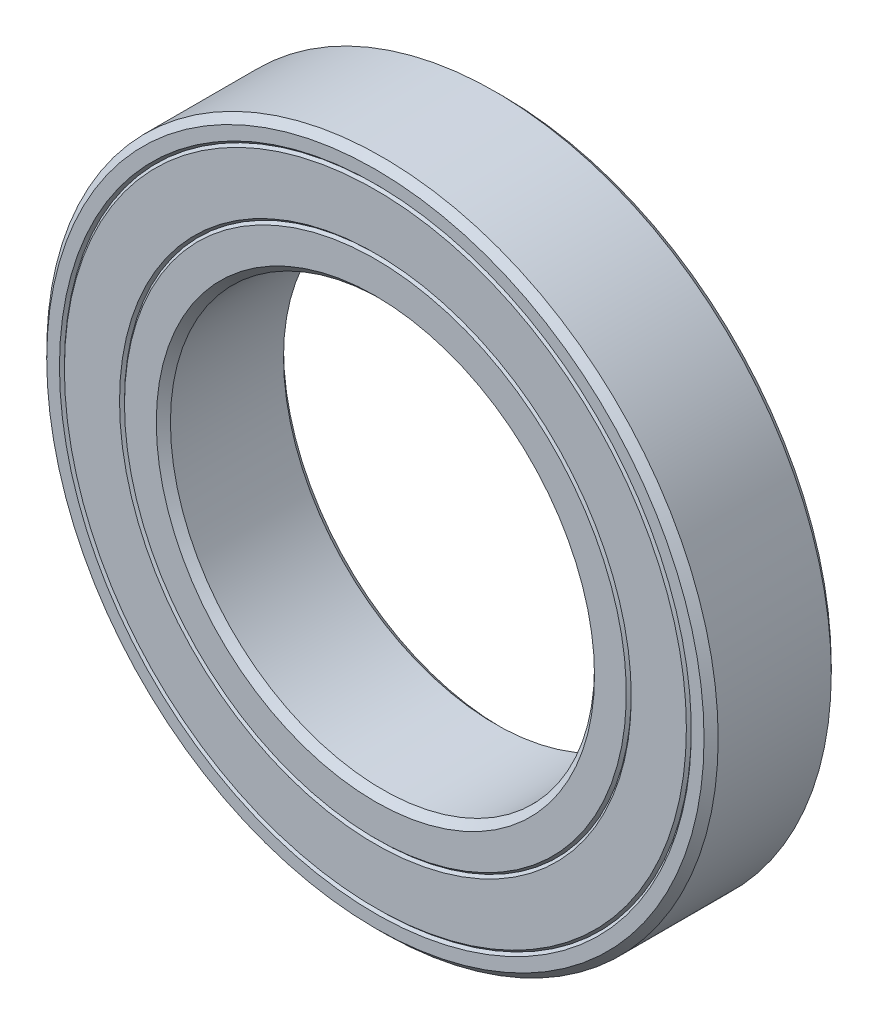
ISO-10303-21;
HEADER;
FILE_DESCRIPTION(('STEP AP214'),'2;1');
FILE_NAME('part.step','',(''),(''),'','','');
FILE_SCHEMA(('AUTOMOTIVE_DESIGN { 1 0 10303 214 1 1 1 1 }'));
ENDSEC;
DATA;
#1=APPLICATION_CONTEXT('core data for automotive mechanical design processes');
#2=APPLICATION_PROTOCOL_DEFINITION('international standard','automotive_design',2000,#1);
#3=PRODUCT_CONTEXT('',#1,'mechanical');
#4=PRODUCT('Part','Part','',(#3));
#5=PRODUCT_RELATED_PRODUCT_CATEGORY('part','',(#4));
#6=PRODUCT_DEFINITION_FORMATION('','',#4);
#7=PRODUCT_DEFINITION_CONTEXT('part definition',#1,'design');
#8=PRODUCT_DEFINITION('design','',#6,#7);
#9=PRODUCT_DEFINITION_SHAPE('','',#8);
#10=(LENGTH_UNIT() NAMED_UNIT(*) SI_UNIT(.MILLI.,.METRE.));
#11=(NAMED_UNIT(*) PLANE_ANGLE_UNIT() SI_UNIT($,.RADIAN.));
#12=(NAMED_UNIT(*) SI_UNIT($,.STERADIAN.) SOLID_ANGLE_UNIT());
#13=UNCERTAINTY_MEASURE_WITH_UNIT(LENGTH_MEASURE(1.E-05),#10,'distance_accuracy_value','');
#14=(GEOMETRIC_REPRESENTATION_CONTEXT(3) GLOBAL_UNCERTAINTY_ASSIGNED_CONTEXT((#13)) GLOBAL_UNIT_ASSIGNED_CONTEXT((#10,
#11,#12)) REPRESENTATION_CONTEXT('',''));
#15=CARTESIAN_POINT('',(0.,0.,0.));
#16=DIRECTION('',(0.,0.,1.));
#17=DIRECTION('',(1.,0.,0.));
#18=AXIS2_PLACEMENT_3D('',#15,#16,#17);
#19=CARTESIAN_POINT('',(0.,0.,18.));
#20=DIRECTION('',(0.,0.,1.));
#21=DIRECTION('',(1.,0.,0.));
#22=AXIS2_PLACEMENT_3D('',#19,#20,#21);
#23=PLANE('',#22);
#24=CARTESIAN_POINT('',(0.,0.,18.));
#25=DIRECTION('',(0.,0.,-1.));
#26=DIRECTION('',(-1.,0.,0.));
#27=AXIS2_PLACEMENT_3D('',#24,#25,#26);
#28=CIRCLE('',#27,35.5);
#29=CARTESIAN_POINT('',(-35.5,0.,18.));
#30=VERTEX_POINT('',#29);
#31=EDGE_CURVE('E91',#30,#30,#28,.T.);
#32=ORIENTED_EDGE('',*,*,#31,.F.);
#33=EDGE_LOOP('',(#32));
#34=FACE_BOUND('',#33,.T.);
#35=CARTESIAN_POINT('',(0.,0.,18.));
#36=DIRECTION('',(0.,0.,1.));
#37=DIRECTION('',(1.,0.,0.));
#38=AXIS2_PLACEMENT_3D('',#35,#36,#37);
#39=CIRCLE('',#38,31.);
#40=CARTESIAN_POINT('',(31.,0.,18.));
#41=VERTEX_POINT('',#40);
#42=EDGE_CURVE('E64',#41,#41,#39,.F.);
#43=ORIENTED_EDGE('',*,*,#42,.T.);
#44=EDGE_LOOP('',(#43));
#45=FACE_BOUND('',#44,.T.);
#46=ADVANCED_FACE('F47',(#34,#45),#23,.T.);
#47=CARTESIAN_POINT('',(0.,0.,0.));
#48=DIRECTION('',(0.,0.,1.));
#49=DIRECTION('',(1.,0.,0.));
#50=AXIS2_PLACEMENT_3D('',#47,#48,#49);
#51=PLANE('',#50);
#52=CARTESIAN_POINT('',(0.,0.,0.));
#53=DIRECTION('',(0.,0.,1.));
#54=DIRECTION('',(1.,0.,0.));
#55=AXIS2_PLACEMENT_3D('',#52,#53,#54);
#56=CIRCLE('',#55,31.);
#57=CARTESIAN_POINT('',(31.,0.,0.));
#58=VERTEX_POINT('',#57);
#59=EDGE_CURVE('E84',#58,#58,#56,.T.);
#60=ORIENTED_EDGE('',*,*,#59,.T.);
#61=EDGE_LOOP('',(#60));
#62=FACE_BOUND('',#61,.T.);
#63=CARTESIAN_POINT('',(0.,0.,0.));
#64=DIRECTION('',(0.,0.,-1.));
#65=DIRECTION('',(-1.,0.,0.));
#66=AXIS2_PLACEMENT_3D('',#63,#64,#65);
#67=CIRCLE('',#66,35.5);
#68=CARTESIAN_POINT('',(-35.5,0.,0.));
#69=VERTEX_POINT('',#68);
#70=EDGE_CURVE('E113',#69,#69,#67,.T.);
#71=ORIENTED_EDGE('',*,*,#70,.T.);
#72=EDGE_LOOP('',(#71));
#73=FACE_BOUND('',#72,.T.);
#74=ADVANCED_FACE('F148',(#62,#73),#51,.F.);
#75=CARTESIAN_POINT('',(0.,0.,18.));
#76=DIRECTION('',(0.,0.,-1.));
#77=DIRECTION('',(-1.,0.,0.));
#78=AXIS2_PLACEMENT_3D('',#75,#76,#77);
#79=CYLINDRICAL_SURFACE('',#78,30.);
#80=CARTESIAN_POINT('',(0.,0.,0.999999999999994));
#81=DIRECTION('',(0.,0.,1.));
#82=DIRECTION('',(1.,0.,0.));
#83=AXIS2_PLACEMENT_3D('',#80,#81,#82);
#84=CIRCLE('',#83,30.);
#85=CARTESIAN_POINT('',(30.,0.,0.999999999999994));
#86=VERTEX_POINT('',#85);
#87=EDGE_CURVE('E77',#86,#86,#84,.F.);
#88=ORIENTED_EDGE('',*,*,#87,.T.);
#89=EDGE_LOOP('',(#88));
#90=FACE_BOUND('',#89,.T.);
#91=CARTESIAN_POINT('',(0.,0.,17.));
#92=DIRECTION('',(0.,0.,1.));
#93=DIRECTION('',(1.,0.,0.));
#94=AXIS2_PLACEMENT_3D('',#91,#92,#93);
#95=CIRCLE('',#94,30.);
#96=CARTESIAN_POINT('',(30.,0.,17.));
#97=VERTEX_POINT('',#96);
#98=EDGE_CURVE('E80',#97,#97,#95,.T.);
#99=ORIENTED_EDGE('',*,*,#98,.T.);
#100=EDGE_LOOP('',(#99));
#101=FACE_BOUND('',#100,.T.);
#102=ADVANCED_FACE('F164',(#90,#101),#79,.F.);
#103=CARTESIAN_POINT('',(0.,0.,0.));
#104=DIRECTION('',(0.,0.,-1.));
#105=DIRECTION('',(-1.,0.,0.));
#106=AXIS2_PLACEMENT_3D('',#103,#104,#105);
#107=CONICAL_SURFACE('',#106,31.,0.785398163397443);
#108=ORIENTED_EDGE('',*,*,#87,.F.);
#109=EDGE_LOOP('',(#108));
#110=FACE_BOUND('',#109,.T.);
#111=ORIENTED_EDGE('',*,*,#59,.F.);
#112=EDGE_LOOP('',(#111));
#113=FACE_BOUND('',#112,.T.);
#114=ADVANCED_FACE('F220',(#110,#113),#107,.F.);
#115=CARTESIAN_POINT('',(0.,0.,17.));
#116=DIRECTION('',(0.,0.,1.));
#117=DIRECTION('',(1.,0.,0.));
#118=AXIS2_PLACEMENT_3D('',#115,#116,#117);
#119=CONICAL_SURFACE('',#118,30.,0.785398163397459);
#120=ORIENTED_EDGE('',*,*,#42,.F.);
#121=EDGE_LOOP('',(#120));
#122=FACE_BOUND('',#121,.T.);
#123=ORIENTED_EDGE('',*,*,#98,.F.);
#124=EDGE_LOOP('',(#123));
#125=FACE_BOUND('',#124,.T.);
#126=ADVANCED_FACE('F225',(#122,#125),#119,.F.);
#127=CARTESIAN_POINT('',(0.,0.,0.349999999999989));
#128=DIRECTION('',(0.,0.,1.));
#129=DIRECTION('',(1.,0.,0.));
#130=AXIS2_PLACEMENT_3D('',#127,#128,#129);
#131=CONICAL_SURFACE('',#130,35.85,0.785398163397458);
#132=ORIENTED_EDGE('',*,*,#70,.F.);
#133=EDGE_LOOP('',(#132));
#134=FACE_BOUND('',#133,.T.);
#135=CARTESIAN_POINT('',(0.,0.,0.349999999999989));
#136=DIRECTION('',(0.,0.,-1.));
#137=DIRECTION('',(-1.,0.,0.));
#138=AXIS2_PLACEMENT_3D('',#135,#136,#137);
#139=CIRCLE('',#138,35.85);
#140=CARTESIAN_POINT('',(-35.85,0.,0.349999999999989));
#141=VERTEX_POINT('',#140);
#142=EDGE_CURVE('E104',#141,#141,#139,.T.);
#143=ORIENTED_EDGE('',*,*,#142,.T.);
#144=EDGE_LOOP('',(#143));
#145=FACE_BOUND('',#144,.T.);
#146=ADVANCED_FACE('F216',(#134,#145),#131,.T.);
#147=CARTESIAN_POINT('',(0.,0.,0.));
#148=DIRECTION('',(0.,0.,-1.));
#149=DIRECTION('',(-1.,0.,0.));
#150=AXIS2_PLACEMENT_3D('',#147,#148,#149);
#151=CONICAL_SURFACE('',#150,36.2,0.785398163397448);
#152=ORIENTED_EDGE('',*,*,#142,.F.);
#153=EDGE_LOOP('',(#152));
#154=FACE_BOUND('',#153,.T.);
#155=CARTESIAN_POINT('',(0.,0.,0.));
#156=DIRECTION('',(0.,0.,-1.));
#157=DIRECTION('',(-1.,0.,0.));
#158=AXIS2_PLACEMENT_3D('',#155,#156,#157);
#159=CIRCLE('',#158,36.2);
#160=CARTESIAN_POINT('',(-36.2,0.,0.));
#161=VERTEX_POINT('',#160);
#162=EDGE_CURVE('E109',#161,#161,#159,.T.);
#163=ORIENTED_EDGE('',*,*,#162,.T.);
#164=EDGE_LOOP('',(#163));
#165=FACE_BOUND('',#164,.T.);
#166=ADVANCED_FACE('F210',(#154,#165),#151,.F.);
#167=CARTESIAN_POINT('',(0.,0.,18.));
#168=DIRECTION('',(0.,0.,-1.));
#169=DIRECTION('',(-1.,0.,0.));
#170=AXIS2_PLACEMENT_3D('',#167,#168,#169);
#171=CONICAL_SURFACE('',#170,35.5,0.785398163397458);
#172=CARTESIAN_POINT('',(0.,0.,17.65));
#173=DIRECTION('',(0.,0.,-1.));
#174=DIRECTION('',(-1.,0.,0.));
#175=AXIS2_PLACEMENT_3D('',#172,#173,#174);
#176=CIRCLE('',#175,35.85);
#177=CARTESIAN_POINT('',(-35.85,0.,17.65));
#178=VERTEX_POINT('',#177);
#179=EDGE_CURVE('E95',#178,#178,#176,.T.);
#180=ORIENTED_EDGE('',*,*,#179,.F.);
#181=EDGE_LOOP('',(#180));
#182=FACE_BOUND('',#181,.T.);
#183=ORIENTED_EDGE('',*,*,#31,.T.);
#184=EDGE_LOOP('',(#183));
#185=FACE_BOUND('',#184,.T.);
#186=ADVANCED_FACE('F204',(#182,#185),#171,.T.);
#187=CARTESIAN_POINT('',(0.,0.,17.65));
#188=DIRECTION('',(0.,0.,1.));
#189=DIRECTION('',(1.,0.,0.));
#190=AXIS2_PLACEMENT_3D('',#187,#188,#189);
#191=CONICAL_SURFACE('',#190,35.85,0.785398163397448);
#192=CARTESIAN_POINT('',(0.,0.,18.));
#193=DIRECTION('',(0.,0.,-1.));
#194=DIRECTION('',(-1.,0.,0.));
#195=AXIS2_PLACEMENT_3D('',#192,#193,#194);
#196=CIRCLE('',#195,36.2);
#197=CARTESIAN_POINT('',(-36.2,0.,18.));
#198=VERTEX_POINT('',#197);
#199=EDGE_CURVE('E99',#198,#198,#196,.T.);
#200=ORIENTED_EDGE('',*,*,#199,.F.);
#201=EDGE_LOOP('',(#200));
#202=FACE_BOUND('',#201,.T.);
#203=ORIENTED_EDGE('',*,*,#179,.T.);
#204=EDGE_LOOP('',(#203));
#205=FACE_BOUND('',#204,.T.);
#206=ADVANCED_FACE('F167',(#202,#205),#191,.F.);
#207=CARTESIAN_POINT('',(0.,0.,0.));
#208=DIRECTION('',(0.,0.,-1.));
#209=DIRECTION('',(-1.,0.,0.));
#210=AXIS2_PLACEMENT_3D('',#207,#208,#209);
#211=CIRCLE('',#210,44.);
#212=CARTESIAN_POINT('',(-44.,0.,0.));
#213=VERTEX_POINT('',#212);
#214=EDGE_CURVE('E131',#213,#213,#211,.T.);
#215=ORIENTED_EDGE('',*,*,#214,.T.);
#216=EDGE_LOOP('',(#215));
#217=FACE_BOUND('',#216,.T.);
#218=ORIENTED_EDGE('',*,*,#162,.F.);
#219=EDGE_LOOP('',(#218));
#220=FACE_BOUND('',#219,.T.);
#221=ADVANCED_FACE('F149',(#217,#220),#51,.F.);
#222=CARTESIAN_POINT('',(0.,0.,0.));
#223=DIRECTION('',(0.,0.,-1.));
#224=DIRECTION('',(-1.,0.,0.));
#225=AXIS2_PLACEMENT_3D('',#222,#223,#224);
#226=CONICAL_SURFACE('',#225,44.7,0.785398163397463);
#227=CARTESIAN_POINT('',(0.,0.,0.35));
#228=DIRECTION('',(0.,0.,-1.));
#229=DIRECTION('',(-1.,0.,0.));
#230=AXIS2_PLACEMENT_3D('',#227,#228,#229);
#231=CIRCLE('',#230,44.35);
#232=CARTESIAN_POINT('',(-44.35,0.,0.35));
#233=VERTEX_POINT('',#232);
#234=EDGE_CURVE('E117',#233,#233,#231,.T.);
#235=ORIENTED_EDGE('',*,*,#234,.F.);
#236=EDGE_LOOP('',(#235));
#237=FACE_BOUND('',#236,.T.);
#238=CARTESIAN_POINT('',(0.,0.,0.));
#239=DIRECTION('',(0.,0.,-1.));
#240=DIRECTION('',(-1.,0.,0.));
#241=AXIS2_PLACEMENT_3D('',#238,#239,#240);
#242=CIRCLE('',#241,44.7);
#243=CARTESIAN_POINT('',(-44.7,0.,0.));
#244=VERTEX_POINT('',#243);
#245=EDGE_CURVE('E134',#244,#244,#242,.T.);
#246=ORIENTED_EDGE('',*,*,#245,.T.);
#247=EDGE_LOOP('',(#246));
#248=FACE_BOUND('',#247,.T.);
#249=ADVANCED_FACE('F140',(#237,#248),#226,.F.);
#250=CARTESIAN_POINT('',(0.,0.,0.35));
#251=DIRECTION('',(0.,0.,1.));
#252=DIRECTION('',(1.,0.,0.));
#253=AXIS2_PLACEMENT_3D('',#250,#251,#252);
#254=CONICAL_SURFACE('',#253,44.35,0.785398163397443);
#255=ORIENTED_EDGE('',*,*,#214,.F.);
#256=EDGE_LOOP('',(#255));
#257=FACE_BOUND('',#256,.T.);
#258=ORIENTED_EDGE('',*,*,#234,.T.);
#259=EDGE_LOOP('',(#258));
#260=FACE_BOUND('',#259,.T.);
#261=ADVANCED_FACE('F182',(#257,#260),#254,.T.);
#262=CARTESIAN_POINT('',(0.,0.,18.));
#263=DIRECTION('',(0.,0.,-1.));
#264=DIRECTION('',(-1.,0.,0.));
#265=AXIS2_PLACEMENT_3D('',#262,#263,#264);
#266=CONICAL_SURFACE('',#265,46.5,0.785398163397441);
#267=CARTESIAN_POINT('',(0.,0.,17.));
#268=DIRECTION('',(0.,0.,1.));
#269=DIRECTION('',(1.,0.,0.));
#270=AXIS2_PLACEMENT_3D('',#267,#268,#269);
#271=CIRCLE('',#270,47.5);
#272=CARTESIAN_POINT('',(47.5,0.,17.));
#273=VERTEX_POINT('',#272);
#274=EDGE_CURVE('E56',#273,#273,#271,.F.);
#275=ORIENTED_EDGE('',*,*,#274,.F.);
#276=EDGE_LOOP('',(#275));
#277=FACE_BOUND('',#276,.T.);
#278=CARTESIAN_POINT('',(0.,0.,18.));
#279=DIRECTION('',(0.,0.,1.));
#280=DIRECTION('',(1.,0.,0.));
#281=AXIS2_PLACEMENT_3D('',#278,#279,#280);
#282=CIRCLE('',#281,46.5);
#283=CARTESIAN_POINT('',(46.5,0.,18.));
#284=VERTEX_POINT('',#283);
#285=EDGE_CURVE('E72',#284,#284,#282,.T.);
#286=ORIENTED_EDGE('',*,*,#285,.F.);
#287=EDGE_LOOP('',(#286));
#288=FACE_BOUND('',#287,.T.);
#289=ADVANCED_FACE('F50',(#277,#288),#266,.T.);
#290=CARTESIAN_POINT('',(0.,0.,18.));
#291=DIRECTION('',(0.,0.,-1.));
#292=DIRECTION('',(-1.,0.,0.));
#293=AXIS2_PLACEMENT_3D('',#290,#291,#292);
#294=CIRCLE('',#293,44.7);
#295=CARTESIAN_POINT('',(-44.7,0.,18.));
#296=VERTEX_POINT('',#295);
#297=EDGE_CURVE('E108',#296,#296,#294,.T.);
#298=ORIENTED_EDGE('',*,*,#297,.T.);
#299=EDGE_LOOP('',(#298));
#300=FACE_BOUND('',#299,.T.);
#301=ORIENTED_EDGE('',*,*,#285,.T.);
#302=EDGE_LOOP('',(#301));
#303=FACE_BOUND('',#302,.T.);
#304=ADVANCED_FACE('F158',(#300,#303),#23,.T.);
#305=CARTESIAN_POINT('',(0.,0.,18.));
#306=DIRECTION('',(0.,0.,-1.));
#307=DIRECTION('',(-1.,0.,0.));
#308=AXIS2_PLACEMENT_3D('',#305,#306,#307);
#309=CYLINDRICAL_SURFACE('',#308,47.5);
#310=CARTESIAN_POINT('',(0.,0.,1.));
#311=DIRECTION('',(0.,0.,1.));
#312=DIRECTION('',(1.,0.,0.));
#313=AXIS2_PLACEMENT_3D('',#310,#311,#312);
#314=CIRCLE('',#313,47.5);
#315=CARTESIAN_POINT('',(47.5,0.,1.));
#316=VERTEX_POINT('',#315);
#317=EDGE_CURVE('E10',#316,#316,#314,.T.);
#318=ORIENTED_EDGE('',*,*,#317,.T.);
#319=EDGE_LOOP('',(#318));
#320=FACE_BOUND('',#319,.T.);
#321=ORIENTED_EDGE('',*,*,#274,.T.);
#322=EDGE_LOOP('',(#321));
#323=FACE_BOUND('',#322,.T.);
#324=ADVANCED_FACE('F160',(#320,#323),#309,.T.);
#325=CARTESIAN_POINT('',(0.,0.,1.));
#326=DIRECTION('',(0.,0.,1.));
#327=DIRECTION('',(1.,0.,0.));
#328=AXIS2_PLACEMENT_3D('',#325,#326,#327);
#329=CONICAL_SURFACE('',#328,47.5,0.785398163397448);
#330=CARTESIAN_POINT('',(0.,0.,0.));
#331=DIRECTION('',(0.,0.,1.));
#332=DIRECTION('',(1.,0.,0.));
#333=AXIS2_PLACEMENT_3D('',#330,#331,#332);
#334=CIRCLE('',#333,46.5);
#335=CARTESIAN_POINT('',(46.5,0.,0.));
#336=VERTEX_POINT('',#335);
#337=EDGE_CURVE('E87',#336,#336,#334,.F.);
#338=ORIENTED_EDGE('',*,*,#337,.F.);
#339=EDGE_LOOP('',(#338));
#340=FACE_BOUND('',#339,.T.);
#341=ORIENTED_EDGE('',*,*,#317,.F.);
#342=EDGE_LOOP('',(#341));
#343=FACE_BOUND('',#342,.T.);
#344=ADVANCED_FACE('F145',(#340,#343),#329,.T.);
#345=ORIENTED_EDGE('',*,*,#337,.T.);
#346=EDGE_LOOP('',(#345));
#347=FACE_BOUND('',#346,.T.);
#348=ORIENTED_EDGE('',*,*,#245,.F.);
#349=EDGE_LOOP('',(#348));
#350=FACE_BOUND('',#349,.T.);
#351=ADVANCED_FACE('F142',(#347,#350),#51,.F.);
#352=CARTESIAN_POINT('',(0.,0.,18.));
#353=DIRECTION('',(0.,0.,-1.));
#354=DIRECTION('',(-1.,0.,0.));
#355=AXIS2_PLACEMENT_3D('',#352,#353,#354);
#356=CIRCLE('',#355,44.);
#357=CARTESIAN_POINT('',(-44.,0.,18.));
#358=VERTEX_POINT('',#357);
#359=EDGE_CURVE('E121',#358,#358,#356,.T.);
#360=ORIENTED_EDGE('',*,*,#359,.F.);
#361=EDGE_LOOP('',(#360));
#362=FACE_BOUND('',#361,.T.);
#363=ORIENTED_EDGE('',*,*,#199,.T.);
#364=EDGE_LOOP('',(#363));
#365=FACE_BOUND('',#364,.T.);
#366=ADVANCED_FACE('F144',(#362,#365),#23,.T.);
#367=CARTESIAN_POINT('',(0.,0.,17.65));
#368=DIRECTION('',(0.,0.,1.));
#369=DIRECTION('',(1.,0.,0.));
#370=AXIS2_PLACEMENT_3D('',#367,#368,#369);
#371=CONICAL_SURFACE('',#370,44.35,0.785398163397483);
#372=ORIENTED_EDGE('',*,*,#297,.F.);
#373=EDGE_LOOP('',(#372));
#374=FACE_BOUND('',#373,.T.);
#375=CARTESIAN_POINT('',(0.,0.,17.65));
#376=DIRECTION('',(0.,0.,-1.));
#377=DIRECTION('',(-1.,0.,0.));
#378=AXIS2_PLACEMENT_3D('',#375,#376,#377);
#379=CIRCLE('',#378,44.35);
#380=CARTESIAN_POINT('',(-44.35,0.,17.65));
#381=VERTEX_POINT('',#380);
#382=EDGE_CURVE('E103',#381,#381,#379,.T.);
#383=ORIENTED_EDGE('',*,*,#382,.T.);
#384=EDGE_LOOP('',(#383));
#385=FACE_BOUND('',#384,.T.);
#386=ADVANCED_FACE('F155',(#374,#385),#371,.F.);
#387=CARTESIAN_POINT('',(0.,0.,18.));
#388=DIRECTION('',(0.,0.,-1.));
#389=DIRECTION('',(-1.,0.,0.));
#390=AXIS2_PLACEMENT_3D('',#387,#388,#389);
#391=CONICAL_SURFACE('',#390,44.,0.785398163397443);
#392=ORIENTED_EDGE('',*,*,#382,.F.);
#393=EDGE_LOOP('',(#392));
#394=FACE_BOUND('',#393,.T.);
#395=ORIENTED_EDGE('',*,*,#359,.T.);
#396=EDGE_LOOP('',(#395));
#397=FACE_BOUND('',#396,.T.);
#398=ADVANCED_FACE('F191',(#394,#397),#391,.T.);
#399=CLOSED_SHELL('',(#46,#74,#102,#114,#126,#146,#166,#186,#206,#221,#249,#261,#289,#304,#324,
#344,#351,#366,#386,#398));
#400=MANIFOLD_SOLID_BREP('B2',#399);
#401=ADVANCED_BREP_SHAPE_REPRESENTATION('',(#18,#400),#14);
#402=SHAPE_DEFINITION_REPRESENTATION(#9,#401);
ENDSEC;
END-ISO-10303-21;
